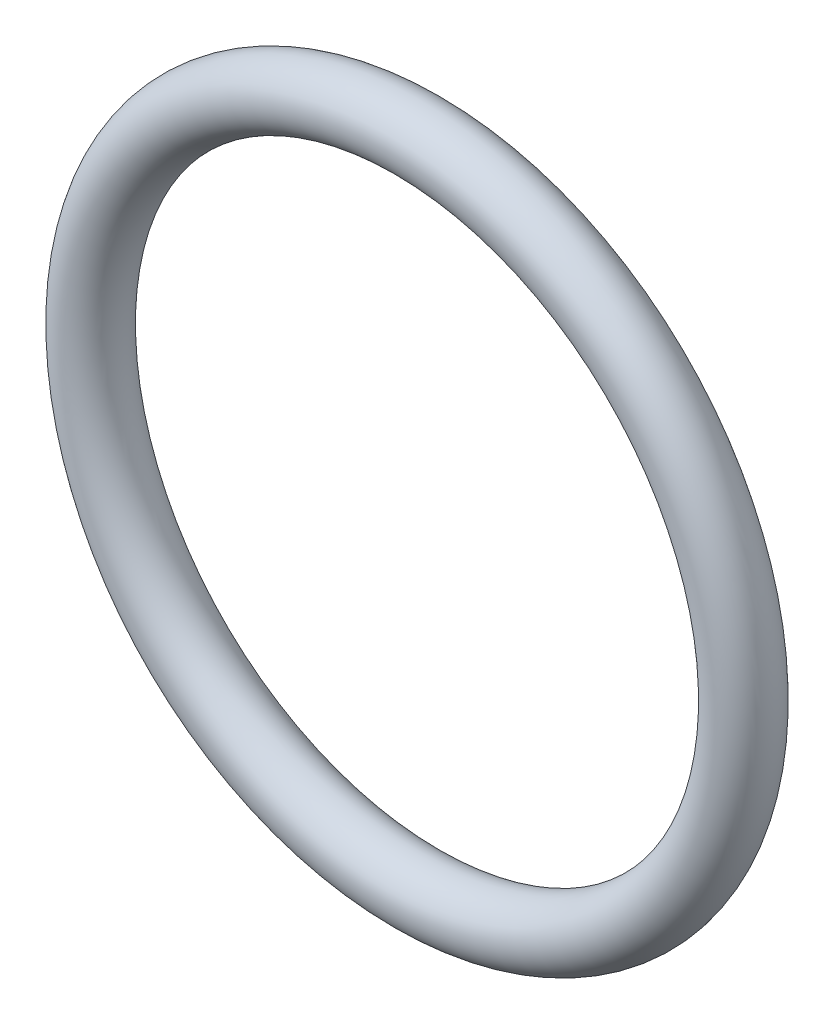
ISO-10303-21;
HEADER;
FILE_DESCRIPTION(('STEP AP214'),'2;1');
FILE_NAME('part.step','',(''),(''),'','','');
FILE_SCHEMA(('AUTOMOTIVE_DESIGN { 1 0 10303 214 1 1 1 1 }'));
ENDSEC;
DATA;
#1=APPLICATION_CONTEXT('core data for automotive mechanical design processes');
#2=APPLICATION_PROTOCOL_DEFINITION('international standard','automotive_design',2000,#1);
#3=PRODUCT_CONTEXT('',#1,'mechanical');
#4=PRODUCT('Part','Part','',(#3));
#5=PRODUCT_RELATED_PRODUCT_CATEGORY('part','',(#4));
#6=PRODUCT_DEFINITION_FORMATION('','',#4);
#7=PRODUCT_DEFINITION_CONTEXT('part definition',#1,'design');
#8=PRODUCT_DEFINITION('design','',#6,#7);
#9=PRODUCT_DEFINITION_SHAPE('','',#8);
#10=(LENGTH_UNIT() NAMED_UNIT(*) SI_UNIT(.MILLI.,.METRE.));
#11=(NAMED_UNIT(*) PLANE_ANGLE_UNIT() SI_UNIT($,.RADIAN.));
#12=(NAMED_UNIT(*) SI_UNIT($,.STERADIAN.) SOLID_ANGLE_UNIT());
#13=UNCERTAINTY_MEASURE_WITH_UNIT(LENGTH_MEASURE(1.E-05),#10,'distance_accuracy_value','');
#14=(GEOMETRIC_REPRESENTATION_CONTEXT(3) GLOBAL_UNCERTAINTY_ASSIGNED_CONTEXT((#13)) GLOBAL_UNIT_ASSIGNED_CONTEXT((#10,
#11,#12)) REPRESENTATION_CONTEXT('',''));
#15=CARTESIAN_POINT('',(0.,0.,0.));
#16=DIRECTION('',(0.,0.,1.));
#17=DIRECTION('',(1.,0.,0.));
#18=AXIS2_PLACEMENT_3D('',#15,#16,#17);
#19=CARTESIAN_POINT('',(0.,0.,0.));
#20=DIRECTION('',(0.,0.,1.));
#21=DIRECTION('',(0.,1.,0.));
#22=AXIS2_PLACEMENT_3D('',#19,#20,#21);
#23=TOROIDAL_SURFACE('',#22,12.35,1.2);
#24=CARTESIAN_POINT('',(0.,13.55,0.));
#25=VERTEX_POINT('',#24);
#26=VERTEX_LOOP('',#25);
#27=FACE_BOUND('',#26,.T.);
#28=ADVANCED_FACE('F32',(#27),#23,.T.);
#29=CLOSED_SHELL('',(#28));
#30=MANIFOLD_SOLID_BREP('B2',#29);
#31=ADVANCED_BREP_SHAPE_REPRESENTATION('',(#18,#30),#14);
#32=SHAPE_DEFINITION_REPRESENTATION(#9,#31);
ENDSEC;
END-ISO-10303-21;
